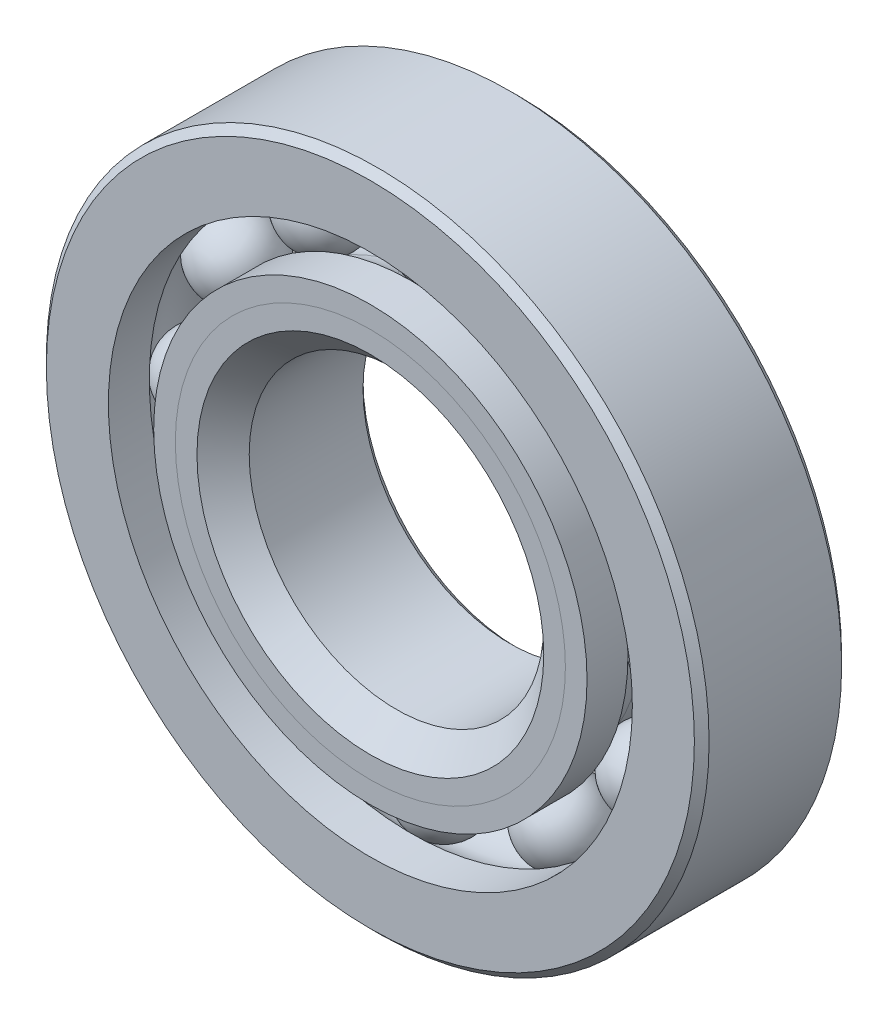
ISO-10303-21;
HEADER;
FILE_DESCRIPTION(('STEP AP214'),'2;1');
FILE_NAME('part.step','',(''),(''),'','','');
FILE_SCHEMA(('AUTOMOTIVE_DESIGN { 1 0 10303 214 1 1 1 1 }'));
ENDSEC;
DATA;
#1=APPLICATION_CONTEXT('core data for automotive mechanical design processes');
#2=APPLICATION_PROTOCOL_DEFINITION('international standard','automotive_design',2000,#1);
#3=PRODUCT_CONTEXT('',#1,'mechanical');
#4=PRODUCT('Part','Part','',(#3));
#5=PRODUCT_RELATED_PRODUCT_CATEGORY('part','',(#4));
#6=PRODUCT_DEFINITION_FORMATION('','',#4);
#7=PRODUCT_DEFINITION_CONTEXT('part definition',#1,'design');
#8=PRODUCT_DEFINITION('design','',#6,#7);
#9=PRODUCT_DEFINITION_SHAPE('','',#8);
#10=(LENGTH_UNIT() NAMED_UNIT(*) SI_UNIT(.MILLI.,.METRE.));
#11=(NAMED_UNIT(*) PLANE_ANGLE_UNIT() SI_UNIT($,.RADIAN.));
#12=(NAMED_UNIT(*) SI_UNIT($,.STERADIAN.) SOLID_ANGLE_UNIT());
#13=UNCERTAINTY_MEASURE_WITH_UNIT(LENGTH_MEASURE(1.E-05),#10,'distance_accuracy_value','');
#14=(GEOMETRIC_REPRESENTATION_CONTEXT(3) GLOBAL_UNCERTAINTY_ASSIGNED_CONTEXT((#13)) GLOBAL_UNIT_ASSIGNED_CONTEXT((#10,
#11,#12)) REPRESENTATION_CONTEXT('',''));
#15=CARTESIAN_POINT('',(0.,0.,0.));
#16=DIRECTION('',(0.,0.,1.));
#17=DIRECTION('',(1.,0.,0.));
#18=AXIS2_PLACEMENT_3D('',#15,#16,#17);
#19=CARTESIAN_POINT('',(-5.15937499999989,8.93629963530074,0.));
#20=DIRECTION('',(0.,0.,1.));
#21=DIRECTION('',(-0.499999999999989,0.866025403784445,0.));
#22=AXIS2_PLACEMENT_3D('',#19,#20,#21);
#23=SPHERICAL_SURFACE('',#22,1.71627890103156);
#24=CARTESIAN_POINT('',(-5.15937499999989,8.93629963530074,1.71627890103155));
#25=VERTEX_POINT('',#24);
#26=VERTEX_LOOP('',#25);
#27=FACE_BOUND('',#26,.T.);
#28=ADVANCED_FACE('F37',(#27),#23,.T.);
#29=CLOSED_SHELL('',(#28));
#30=MANIFOLD_SOLID_BREP('B2',#29);
#31=CARTESIAN_POINT('',(-8.93629963530062,5.1593750000001,0.));
#32=DIRECTION('',(0.,0.,1.));
#33=DIRECTION('',(-0.866025403784433,0.50000000000001,0.));
#34=AXIS2_PLACEMENT_3D('',#31,#32,#33);
#35=SPHERICAL_SURFACE('',#34,1.71627890103156);
#36=CARTESIAN_POINT('',(-8.93629963530062,5.1593750000001,1.71627890103155));
#37=VERTEX_POINT('',#36);
#38=VERTEX_LOOP('',#37);
#39=FACE_BOUND('',#38,.T.);
#40=ADVANCED_FACE('F68',(#39),#35,.T.);
#41=CLOSED_SHELL('',(#40));
#42=MANIFOLD_SOLID_BREP('B6',#41);
#43=CARTESIAN_POINT('',(-10.31875,1.08083169195563E-13,0.));
#44=DIRECTION('',(0.,0.,1.));
#45=DIRECTION('',(-1.,0.,0.));
#46=AXIS2_PLACEMENT_3D('',#43,#44,#45);
#47=SPHERICAL_SURFACE('',#46,1.71627890103156);
#48=CARTESIAN_POINT('',(-10.31875,1.08083169195563E-13,1.71627890103155));
#49=VERTEX_POINT('',#48);
#50=VERTEX_LOOP('',#49);
#51=FACE_BOUND('',#50,.T.);
#52=ADVANCED_FACE('F99',(#51),#47,.T.);
#53=CLOSED_SHELL('',(#52));
#54=MANIFOLD_SOLID_BREP('B33',#53);
#55=CARTESIAN_POINT('',(-8.93629963530072,-5.15937499999992,0.));
#56=DIRECTION('',(0.,0.,1.));
#57=DIRECTION('',(-0.866025403784443,-0.499999999999992,0.));
#58=AXIS2_PLACEMENT_3D('',#55,#56,#57);
#59=SPHERICAL_SURFACE('',#58,1.71627890103156);
#60=CARTESIAN_POINT('',(-8.93629963530072,-5.15937499999992,1.71627890103155));
#61=VERTEX_POINT('',#60);
#62=VERTEX_LOOP('',#61);
#63=FACE_BOUND('',#62,.T.);
#64=ADVANCED_FACE('F130',(#63),#59,.T.);
#65=CLOSED_SHELL('',(#64));
#66=MANIFOLD_SOLID_BREP('B64',#65);
#67=CARTESIAN_POINT('',(-5.15937500000007,-8.93629963530064,0.));
#68=DIRECTION('',(0.,0.,1.));
#69=DIRECTION('',(-0.500000000000007,-0.866025403784435,0.));
#70=AXIS2_PLACEMENT_3D('',#67,#68,#69);
#71=SPHERICAL_SURFACE('',#70,1.71627890103156);
#72=CARTESIAN_POINT('',(-5.15937500000007,-8.93629963530064,1.71627890103155));
#73=VERTEX_POINT('',#72);
#74=VERTEX_LOOP('',#73);
#75=FACE_BOUND('',#74,.T.);
#76=ADVANCED_FACE('F161',(#75),#71,.T.);
#77=CLOSED_SHELL('',(#76));
#78=MANIFOLD_SOLID_BREP('B95',#77);
#79=CARTESIAN_POINT('',(0.,-10.31875,0.));
#80=DIRECTION('',(0.,0.,1.));
#81=DIRECTION('',(0.,-1.,0.));
#82=AXIS2_PLACEMENT_3D('',#79,#80,#81);
#83=SPHERICAL_SURFACE('',#82,1.71627890103156);
#84=CARTESIAN_POINT('',(0.,-10.31875,1.71627890103155));
#85=VERTEX_POINT('',#84);
#86=VERTEX_LOOP('',#85);
#87=FACE_BOUND('',#86,.T.);
#88=ADVANCED_FACE('F192',(#87),#83,.T.);
#89=CLOSED_SHELL('',(#88));
#90=MANIFOLD_SOLID_BREP('B126',#89);
#91=CARTESIAN_POINT('',(5.15937499999995,-8.93629963530071,0.));
#92=DIRECTION('',(0.,0.,1.));
#93=DIRECTION('',(0.499999999999995,-0.866025403784442,0.));
#94=AXIS2_PLACEMENT_3D('',#91,#92,#93);
#95=SPHERICAL_SURFACE('',#94,1.71627890103156);
#96=CARTESIAN_POINT('',(5.15937499999995,-8.93629963530071,1.71627890103155));
#97=VERTEX_POINT('',#96);
#98=VERTEX_LOOP('',#97);
#99=FACE_BOUND('',#98,.T.);
#100=ADVANCED_FACE('F223',(#99),#95,.T.);
#101=CLOSED_SHELL('',(#100));
#102=MANIFOLD_SOLID_BREP('B157',#101);
#103=CARTESIAN_POINT('',(8.93629963530065,-5.15937500000004,0.));
#104=DIRECTION('',(0.,0.,1.));
#105=DIRECTION('',(0.866025403784436,-0.500000000000004,0.));
#106=AXIS2_PLACEMENT_3D('',#103,#104,#105);
#107=SPHERICAL_SURFACE('',#106,1.71627890103156);
#108=CARTESIAN_POINT('',(8.93629963530065,-5.15937500000004,1.71627890103155));
#109=VERTEX_POINT('',#108);
#110=VERTEX_LOOP('',#109);
#111=FACE_BOUND('',#110,.T.);
#112=ADVANCED_FACE('F254',(#111),#107,.T.);
#113=CLOSED_SHELL('',(#112));
#114=MANIFOLD_SOLID_BREP('B188',#113);
#115=CARTESIAN_POINT('',(10.31875,0.,0.));
#116=DIRECTION('',(0.,0.,1.));
#117=DIRECTION('',(1.,0.,0.));
#118=AXIS2_PLACEMENT_3D('',#115,#116,#117);
#119=SPHERICAL_SURFACE('',#118,1.71627890103156);
#120=CARTESIAN_POINT('',(10.31875,0.,1.71627890103155));
#121=VERTEX_POINT('',#120);
#122=VERTEX_LOOP('',#121);
#123=FACE_BOUND('',#122,.T.);
#124=ADVANCED_FACE('F285',(#123),#119,.T.);
#125=CLOSED_SHELL('',(#124));
#126=MANIFOLD_SOLID_BREP('B219',#125);
#127=CARTESIAN_POINT('',(8.93629963530069,5.15937499999998,0.));
#128=DIRECTION('',(0.,0.,1.));
#129=DIRECTION('',(0.86602540378444,0.499999999999998,0.));
#130=AXIS2_PLACEMENT_3D('',#127,#128,#129);
#131=SPHERICAL_SURFACE('',#130,1.71627890103156);
#132=CARTESIAN_POINT('',(8.93629963530069,5.15937499999998,1.71627890103155));
#133=VERTEX_POINT('',#132);
#134=VERTEX_LOOP('',#133);
#135=FACE_BOUND('',#134,.T.);
#136=ADVANCED_FACE('F316',(#135),#131,.T.);
#137=CLOSED_SHELL('',(#136));
#138=MANIFOLD_SOLID_BREP('B250',#137);
#139=CARTESIAN_POINT('',(5.15937500000001,8.93629963530067,0.));
#140=DIRECTION('',(0.,0.,1.));
#141=DIRECTION('',(0.500000000000001,0.866025403784438,0.));
#142=AXIS2_PLACEMENT_3D('',#139,#140,#141);
#143=SPHERICAL_SURFACE('',#142,1.71627890103156);
#144=CARTESIAN_POINT('',(5.15937500000001,8.93629963530067,1.71627890103155));
#145=VERTEX_POINT('',#144);
#146=VERTEX_LOOP('',#145);
#147=FACE_BOUND('',#146,.T.);
#148=ADVANCED_FACE('F347',(#147),#143,.T.);
#149=CLOSED_SHELL('',(#148));
#150=MANIFOLD_SOLID_BREP('B281',#149);
#151=CARTESIAN_POINT('',(0.,10.31875,0.));
#152=DIRECTION('',(0.,0.,1.));
#153=DIRECTION('',(0.,1.,0.));
#154=AXIS2_PLACEMENT_3D('',#151,#152,#153);
#155=SPHERICAL_SURFACE('',#154,1.71627890103156);
#156=CARTESIAN_POINT('',(0.,10.31875,1.71627890103155));
#157=VERTEX_POINT('',#156);
#158=VERTEX_LOOP('',#157);
#159=FACE_BOUND('',#158,.T.);
#160=ADVANCED_FACE('F380',(#159),#155,.T.);
#161=CLOSED_SHELL('',(#160));
#162=MANIFOLD_SOLID_BREP('B312',#161);
#163=CARTESIAN_POINT('',(0.,8.40903123628057,3.175));
#164=DIRECTION('',(0.,0.,-1.));
#165=DIRECTION('',(-1.,0.,0.));
#166=AXIS2_PLACEMENT_3D('',#163,#164,#165);
#167=PLANE('',#166);
#168=CARTESIAN_POINT('',(0.,0.,3.175));
#169=DIRECTION('',(0.,0.,1.));
#170=DIRECTION('',(1.,0.,0.));
#171=AXIS2_PLACEMENT_3D('',#168,#169,#170);
#172=CIRCLE('',#171,7.47623554948422);
#173=CARTESIAN_POINT('',(7.47623554948422,0.,3.175));
#174=VERTEX_POINT('',#173);
#175=EDGE_CURVE('E434',#174,#174,#172,.T.);
#176=ORIENTED_EDGE('',*,*,#175,.F.);
#177=EDGE_LOOP('',(#176));
#178=FACE_BOUND('',#177,.T.);
#179=CARTESIAN_POINT('',(0.,0.,3.175));
#180=DIRECTION('',(0.,0.,1.));
#181=DIRECTION('',(1.,0.,0.));
#182=AXIS2_PLACEMENT_3D('',#179,#180,#181);
#183=CIRCLE('',#182,8.40903123628057);
#184=CARTESIAN_POINT('',(8.40903123628057,0.,3.175));
#185=VERTEX_POINT('',#184);
#186=EDGE_CURVE('E379',#185,#185,#183,.T.);
#187=ORIENTED_EDGE('',*,*,#186,.T.);
#188=EDGE_LOOP('',(#187));
#189=FACE_BOUND('',#188,.T.);
#190=ADVANCED_FACE('F400',(#178,#189),#167,.F.);
#191=CARTESIAN_POINT('',(0.,0.,2.24220431320365));
#192=DIRECTION('',(0.,0.,1.));
#193=DIRECTION('',(1.,0.,0.));
#194=AXIS2_PLACEMENT_3D('',#191,#192,#193);
#195=CONICAL_SURFACE('',#194,7.47623554948422,0.78539816339745);
#196=ORIENTED_EDGE('',*,*,#186,.F.);
#197=EDGE_LOOP('',(#196));
#198=FACE_BOUND('',#197,.T.);
#199=CARTESIAN_POINT('',(0.,0.,2.24220431320365));
#200=DIRECTION('',(0.,0.,1.));
#201=DIRECTION('',(1.,0.,0.));
#202=AXIS2_PLACEMENT_3D('',#199,#200,#201);
#203=CIRCLE('',#202,7.47623554948422);
#204=CARTESIAN_POINT('',(7.47623554948422,0.,2.24220431320365));
#205=VERTEX_POINT('',#204);
#206=EDGE_CURVE('E406',#205,#205,#203,.T.);
#207=ORIENTED_EDGE('',*,*,#206,.T.);
#208=EDGE_LOOP('',(#207));
#209=FACE_BOUND('',#208,.T.);
#210=ADVANCED_FACE('F441',(#198,#209),#195,.T.);
#211=CARTESIAN_POINT('',(0.,0.,3.175));
#212=DIRECTION('',(0.,0.,1.));
#213=DIRECTION('',(1.,0.,0.));
#214=AXIS2_PLACEMENT_3D('',#211,#212,#213);
#215=CYLINDRICAL_SURFACE('',#214,7.47623554948422);
#216=ORIENTED_EDGE('',*,*,#206,.F.);
#217=EDGE_LOOP('',(#216));
#218=FACE_BOUND('',#217,.T.);
#219=CARTESIAN_POINT('',(0.,0.,0.));
#220=DIRECTION('',(0.,0.,1.));
#221=DIRECTION('',(1.,0.,0.));
#222=AXIS2_PLACEMENT_3D('',#219,#220,#221);
#223=CIRCLE('',#222,7.47623554948422);
#224=CARTESIAN_POINT('',(7.47623554948422,0.,0.));
#225=VERTEX_POINT('',#224);
#226=EDGE_CURVE('E410',#225,#225,#223,.T.);
#227=ORIENTED_EDGE('',*,*,#226,.T.);
#228=EDGE_LOOP('',(#227));
#229=FACE_BOUND('',#228,.T.);
#230=ADVANCED_FACE('F445',(#218,#229),#215,.T.);
#231=CARTESIAN_POINT('',(0.,7.47623554948422,0.));
#232=DIRECTION('',(0.,0.,-1.));
#233=DIRECTION('',(-1.,0.,0.));
#234=AXIS2_PLACEMENT_3D('',#231,#232,#233);
#235=PLANE('',#234);
#236=ORIENTED_EDGE('',*,*,#226,.F.);
#237=EDGE_LOOP('',(#236));
#238=FACE_BOUND('',#237,.T.);
#239=CARTESIAN_POINT('',(0.,0.,0.));
#240=DIRECTION('',(0.,0.,1.));
#241=DIRECTION('',(1.,0.,0.));
#242=AXIS2_PLACEMENT_3D('',#239,#240,#241);
#243=CIRCLE('',#242,8.60247109896845);
#244=CARTESIAN_POINT('',(8.60247109896845,0.,0.));
#245=VERTEX_POINT('',#244);
#246=EDGE_CURVE('E414',#245,#245,#243,.T.);
#247=ORIENTED_EDGE('',*,*,#246,.T.);
#248=EDGE_LOOP('',(#247));
#249=FACE_BOUND('',#248,.T.);
#250=ADVANCED_FACE('F450',(#238,#249),#235,.F.);
#251=CARTESIAN_POINT('',(0.,0.,0.));
#252=DIRECTION('',(0.,0.,1.));
#253=DIRECTION('',(1.,0.,0.));
#254=AXIS2_PLACEMENT_3D('',#251,#252,#253);
#255=TOROIDAL_SURFACE('',#254,10.31875,1.71627890103155);
#256=ORIENTED_EDGE('',*,*,#246,.F.);
#257=EDGE_LOOP('',(#256));
#258=FACE_BOUND('',#257,.T.);
#259=CARTESIAN_POINT('',(0.,0.,-1.41111111111111));
#260=DIRECTION('',(0.,0.,1.));
#261=DIRECTION('',(1.,0.,0.));
#262=AXIS2_PLACEMENT_3D('',#259,#260,#261);
#263=CIRCLE('',#262,9.34182692307692);
#264=CARTESIAN_POINT('',(9.34182692307692,0.,-1.41111111111111));
#265=VERTEX_POINT('',#264);
#266=EDGE_CURVE('E419',#265,#265,#263,.T.);
#267=ORIENTED_EDGE('',*,*,#266,.T.);
#268=EDGE_LOOP('',(#267));
#269=FACE_BOUND('',#268,.T.);
#270=ADVANCED_FACE('F456',(#258,#269),#255,.F.);
#271=CARTESIAN_POINT('',(0.,0.,3.175));
#272=DIRECTION('',(0.,0.,1.));
#273=DIRECTION('',(1.,0.,0.));
#274=AXIS2_PLACEMENT_3D('',#271,#272,#273);
#275=CYLINDRICAL_SURFACE('',#274,9.34182692307692);
#276=ORIENTED_EDGE('',*,*,#266,.F.);
#277=EDGE_LOOP('',(#276));
#278=FACE_BOUND('',#277,.T.);
#279=CARTESIAN_POINT('',(0.,0.,-3.175));
#280=DIRECTION('',(0.,0.,1.));
#281=DIRECTION('',(1.,0.,0.));
#282=AXIS2_PLACEMENT_3D('',#279,#280,#281);
#283=CIRCLE('',#282,9.34182692307692);
#284=CARTESIAN_POINT('',(9.34182692307692,0.,-3.175));
#285=VERTEX_POINT('',#284);
#286=EDGE_CURVE('E422',#285,#285,#283,.T.);
#287=ORIENTED_EDGE('',*,*,#286,.T.);
#288=EDGE_LOOP('',(#287));
#289=FACE_BOUND('',#288,.T.);
#290=ADVANCED_FACE('F460',(#278,#289),#275,.T.);
#291=CARTESIAN_POINT('',(0.,6.6675,-3.175));
#292=DIRECTION('',(0.,0.,1.));
#293=DIRECTION('',(1.,0.,0.));
#294=AXIS2_PLACEMENT_3D('',#291,#292,#293);
#295=PLANE('',#294);
#296=ORIENTED_EDGE('',*,*,#286,.F.);
#297=EDGE_LOOP('',(#296));
#298=FACE_BOUND('',#297,.T.);
#299=CARTESIAN_POINT('',(0.,0.,-3.175));
#300=DIRECTION('',(0.,0.,1.));
#301=DIRECTION('',(1.,0.,0.));
#302=AXIS2_PLACEMENT_3D('',#299,#300,#301);
#303=CIRCLE('',#302,6.6675);
#304=CARTESIAN_POINT('',(6.6675,0.,-3.175));
#305=VERTEX_POINT('',#304);
#306=EDGE_CURVE('E425',#305,#305,#303,.T.);
#307=ORIENTED_EDGE('',*,*,#306,.T.);
#308=EDGE_LOOP('',(#307));
#309=FACE_BOUND('',#308,.T.);
#310=ADVANCED_FACE('F464',(#298,#309),#295,.F.);
#311=CARTESIAN_POINT('',(0.,0.,-2.8575));
#312=DIRECTION('',(0.,0.,-1.));
#313=DIRECTION('',(-1.,0.,0.));
#314=AXIS2_PLACEMENT_3D('',#311,#312,#313);
#315=CONICAL_SURFACE('',#314,6.35,0.785398163397446);
#316=ORIENTED_EDGE('',*,*,#306,.F.);
#317=EDGE_LOOP('',(#316));
#318=FACE_BOUND('',#317,.T.);
#319=CARTESIAN_POINT('',(0.,0.,-2.8575));
#320=DIRECTION('',(0.,0.,1.));
#321=DIRECTION('',(1.,0.,0.));
#322=AXIS2_PLACEMENT_3D('',#319,#320,#321);
#323=CIRCLE('',#322,6.35);
#324=CARTESIAN_POINT('',(6.35,0.,-2.8575));
#325=VERTEX_POINT('',#324);
#326=EDGE_CURVE('E428',#325,#325,#323,.T.);
#327=ORIENTED_EDGE('',*,*,#326,.T.);
#328=EDGE_LOOP('',(#327));
#329=FACE_BOUND('',#328,.T.);
#330=ADVANCED_FACE('F468',(#318,#329),#315,.F.);
#331=CARTESIAN_POINT('',(0.,0.,3.175));
#332=DIRECTION('',(0.,0.,1.));
#333=DIRECTION('',(1.,0.,0.));
#334=AXIS2_PLACEMENT_3D('',#331,#332,#333);
#335=CYLINDRICAL_SURFACE('',#334,6.35);
#336=ORIENTED_EDGE('',*,*,#326,.F.);
#337=EDGE_LOOP('',(#336));
#338=FACE_BOUND('',#337,.T.);
#339=CARTESIAN_POINT('',(0.,0.,2.04876445051578));
#340=DIRECTION('',(0.,0.,1.));
#341=DIRECTION('',(1.,0.,0.));
#342=AXIS2_PLACEMENT_3D('',#339,#340,#341);
#343=CIRCLE('',#342,6.35);
#344=CARTESIAN_POINT('',(6.35,0.,2.04876445051578));
#345=VERTEX_POINT('',#344);
#346=EDGE_CURVE('E431',#345,#345,#343,.T.);
#347=ORIENTED_EDGE('',*,*,#346,.T.);
#348=EDGE_LOOP('',(#347));
#349=FACE_BOUND('',#348,.T.);
#350=ADVANCED_FACE('F472',(#338,#349),#335,.F.);
#351=CARTESIAN_POINT('',(0.,0.,3.175));
#352=DIRECTION('',(0.,0.,1.));
#353=DIRECTION('',(1.,0.,0.));
#354=AXIS2_PLACEMENT_3D('',#351,#352,#353);
#355=CONICAL_SURFACE('',#354,7.47623554948422,0.78539816339745);
#356=ORIENTED_EDGE('',*,*,#346,.F.);
#357=EDGE_LOOP('',(#356));
#358=FACE_BOUND('',#357,.T.);
#359=ORIENTED_EDGE('',*,*,#175,.T.);
#360=EDGE_LOOP('',(#359));
#361=FACE_BOUND('',#360,.T.);
#362=ADVANCED_FACE('F438',(#358,#361),#355,.F.);
#363=CLOSED_SHELL('',(#190,#210,#230,#250,#270,#290,#310,#330,#350,#362));
#364=MANIFOLD_SOLID_BREP('B343',#363);
#365=CARTESIAN_POINT('',(0.,9.34182692307692,3.175));
#366=DIRECTION('',(0.,0.,-1.));
#367=DIRECTION('',(-1.,0.,0.));
#368=AXIS2_PLACEMENT_3D('',#365,#366,#367);
#369=PLANE('',#368);
#370=CARTESIAN_POINT('',(0.,0.,3.175));
#371=DIRECTION('',(0.,0.,1.));
#372=DIRECTION('',(1.,0.,0.));
#373=AXIS2_PLACEMENT_3D('',#370,#371,#372);
#374=CIRCLE('',#373,8.40903123628057);
#375=CARTESIAN_POINT('',(8.40903123628057,0.,3.175));
#376=VERTEX_POINT('',#375);
#377=EDGE_CURVE('E399',#376,#376,#374,.T.);
#378=ORIENTED_EDGE('',*,*,#377,.F.);
#379=EDGE_LOOP('',(#378));
#380=FACE_BOUND('',#379,.T.);
#381=CARTESIAN_POINT('',(0.,0.,3.175));
#382=DIRECTION('',(0.,0.,1.));
#383=DIRECTION('',(1.,0.,0.));
#384=AXIS2_PLACEMENT_3D('',#381,#382,#383);
#385=CIRCLE('',#384,9.34182692307692);
#386=CARTESIAN_POINT('',(9.34182692307692,0.,3.175));
#387=VERTEX_POINT('',#386);
#388=EDGE_CURVE('E580',#387,#387,#385,.T.);
#389=ORIENTED_EDGE('',*,*,#388,.T.);
#390=EDGE_LOOP('',(#389));
#391=FACE_BOUND('',#390,.T.);
#392=ADVANCED_FACE('F558',(#380,#391),#369,.F.);
#393=CARTESIAN_POINT('',(0.,0.,3.175));
#394=DIRECTION('',(0.,0.,1.));
#395=DIRECTION('',(1.,0.,0.));
#396=AXIS2_PLACEMENT_3D('',#393,#394,#395);
#397=CONICAL_SURFACE('',#396,8.40903123628057,0.78539816339745);
#398=CARTESIAN_POINT('',(0.,0.,2.24220431320365));
#399=DIRECTION('',(0.,0.,1.));
#400=DIRECTION('',(1.,0.,0.));
#401=AXIS2_PLACEMENT_3D('',#398,#399,#400);
#402=CIRCLE('',#401,7.47623554948422);
#403=CARTESIAN_POINT('',(7.47623554948422,0.,2.24220431320365));
#404=VERTEX_POINT('',#403);
#405=EDGE_CURVE('E564',#404,#404,#402,.T.);
#406=ORIENTED_EDGE('',*,*,#405,.F.);
#407=EDGE_LOOP('',(#406));
#408=FACE_BOUND('',#407,.T.);
#409=ORIENTED_EDGE('',*,*,#377,.T.);
#410=EDGE_LOOP('',(#409));
#411=FACE_BOUND('',#410,.T.);
#412=ADVANCED_FACE('F605',(#408,#411),#397,.F.);
#413=CARTESIAN_POINT('',(0.,0.,3.175));
#414=DIRECTION('',(0.,0.,1.));
#415=DIRECTION('',(1.,0.,0.));
#416=AXIS2_PLACEMENT_3D('',#413,#414,#415);
#417=CYLINDRICAL_SURFACE('',#416,7.47623554948422);
#418=CARTESIAN_POINT('',(0.,0.,0.));
#419=DIRECTION('',(0.,0.,1.));
#420=DIRECTION('',(1.,0.,0.));
#421=AXIS2_PLACEMENT_3D('',#418,#419,#420);
#422=CIRCLE('',#421,7.47623554948422);
#423=CARTESIAN_POINT('',(7.47623554948422,0.,0.));
#424=VERTEX_POINT('',#423);
#425=EDGE_CURVE('E568',#424,#424,#422,.T.);
#426=ORIENTED_EDGE('',*,*,#425,.F.);
#427=EDGE_LOOP('',(#426));
#428=FACE_BOUND('',#427,.T.);
#429=ORIENTED_EDGE('',*,*,#405,.T.);
#430=EDGE_LOOP('',(#429));
#431=FACE_BOUND('',#430,.T.);
#432=ADVANCED_FACE('F600',(#428,#431),#417,.F.);
#433=CARTESIAN_POINT('',(0.,7.47623554948422,0.));
#434=DIRECTION('',(0.,0.,1.));
#435=DIRECTION('',(1.,0.,0.));
#436=AXIS2_PLACEMENT_3D('',#433,#434,#435);
#437=PLANE('',#436);
#438=CARTESIAN_POINT('',(0.,0.,0.));
#439=DIRECTION('',(0.,0.,1.));
#440=DIRECTION('',(1.,0.,0.));
#441=AXIS2_PLACEMENT_3D('',#438,#439,#440);
#442=CIRCLE('',#441,8.60247109896845);
#443=CARTESIAN_POINT('',(8.60247109896845,0.,0.));
#444=VERTEX_POINT('',#443);
#445=EDGE_CURVE('E572',#444,#444,#442,.T.);
#446=ORIENTED_EDGE('',*,*,#445,.F.);
#447=EDGE_LOOP('',(#446));
#448=FACE_BOUND('',#447,.T.);
#449=ORIENTED_EDGE('',*,*,#425,.T.);
#450=EDGE_LOOP('',(#449));
#451=FACE_BOUND('',#450,.T.);
#452=ADVANCED_FACE('F594',(#448,#451),#437,.F.);
#453=CARTESIAN_POINT('',(0.,0.,0.));
#454=DIRECTION('',(0.,0.,1.));
#455=DIRECTION('',(1.,0.,0.));
#456=AXIS2_PLACEMENT_3D('',#453,#454,#455);
#457=TOROIDAL_SURFACE('',#456,10.31875,1.71627890103156);
#458=CARTESIAN_POINT('',(0.,0.,1.41111111111111));
#459=DIRECTION('',(0.,0.,1.));
#460=DIRECTION('',(1.,0.,0.));
#461=AXIS2_PLACEMENT_3D('',#458,#459,#460);
#462=CIRCLE('',#461,9.34182692307692);
#463=CARTESIAN_POINT('',(9.34182692307692,0.,1.41111111111111));
#464=VERTEX_POINT('',#463);
#465=EDGE_CURVE('E577',#464,#464,#462,.T.);
#466=ORIENTED_EDGE('',*,*,#465,.F.);
#467=EDGE_LOOP('',(#466));
#468=FACE_BOUND('',#467,.T.);
#469=ORIENTED_EDGE('',*,*,#445,.T.);
#470=EDGE_LOOP('',(#469));
#471=FACE_BOUND('',#470,.T.);
#472=ADVANCED_FACE('F588',(#468,#471),#457,.F.);
#473=CARTESIAN_POINT('',(0.,0.,3.175));
#474=DIRECTION('',(0.,0.,1.));
#475=DIRECTION('',(1.,0.,0.));
#476=AXIS2_PLACEMENT_3D('',#473,#474,#475);
#477=CYLINDRICAL_SURFACE('',#476,9.34182692307692);
#478=ORIENTED_EDGE('',*,*,#388,.F.);
#479=EDGE_LOOP('',(#478));
#480=FACE_BOUND('',#479,.T.);
#481=ORIENTED_EDGE('',*,*,#465,.T.);
#482=EDGE_LOOP('',(#481));
#483=FACE_BOUND('',#482,.T.);
#484=ADVANCED_FACE('F585',(#480,#483),#477,.T.);
#485=CLOSED_SHELL('',(#392,#412,#432,#452,#472,#484));
#486=MANIFOLD_SOLID_BREP('B374',#485);
#487=CARTESIAN_POINT('',(0.,0.,2.8575));
#488=DIRECTION('',(0.,0.,-1.));
#489=DIRECTION('',(-1.,0.,0.));
#490=AXIS2_PLACEMENT_3D('',#487,#488,#489);
#491=CONICAL_SURFACE('',#490,14.2875,0.785398163397451);
#492=CARTESIAN_POINT('',(0.,0.,3.175));
#493=DIRECTION('',(0.,0.,1.));
#494=DIRECTION('',(1.,0.,0.));
#495=AXIS2_PLACEMENT_3D('',#492,#493,#494);
#496=CIRCLE('',#495,13.97);
#497=CARTESIAN_POINT('',(13.97,0.,3.175));
#498=VERTEX_POINT('',#497);
#499=EDGE_CURVE('E677',#498,#498,#496,.T.);
#500=ORIENTED_EDGE('',*,*,#499,.F.);
#501=EDGE_LOOP('',(#500));
#502=FACE_BOUND('',#501,.T.);
#503=CARTESIAN_POINT('',(0.,0.,2.8575));
#504=DIRECTION('',(0.,0.,1.));
#505=DIRECTION('',(1.,0.,0.));
#506=AXIS2_PLACEMENT_3D('',#503,#504,#505);
#507=CIRCLE('',#506,14.2875);
#508=CARTESIAN_POINT('',(14.2875,0.,2.8575));
#509=VERTEX_POINT('',#508);
#510=EDGE_CURVE('E557',#509,#509,#507,.T.);
#511=ORIENTED_EDGE('',*,*,#510,.T.);
#512=EDGE_LOOP('',(#511));
#513=FACE_BOUND('',#512,.T.);
#514=ADVANCED_FACE('F649',(#502,#513),#491,.T.);
#515=CARTESIAN_POINT('',(0.,0.,3.175));
#516=DIRECTION('',(0.,0.,1.));
#517=DIRECTION('',(1.,0.,0.));
#518=AXIS2_PLACEMENT_3D('',#515,#516,#517);
#519=CYLINDRICAL_SURFACE('',#518,14.2875);
#520=ORIENTED_EDGE('',*,*,#510,.F.);
#521=EDGE_LOOP('',(#520));
#522=FACE_BOUND('',#521,.T.);
#523=CARTESIAN_POINT('',(0.,0.,-2.8575));
#524=DIRECTION('',(0.,0.,1.));
#525=DIRECTION('',(1.,0.,0.));
#526=AXIS2_PLACEMENT_3D('',#523,#524,#525);
#527=CIRCLE('',#526,14.2875);
#528=CARTESIAN_POINT('',(14.2875,0.,-2.8575));
#529=VERTEX_POINT('',#528);
#530=EDGE_CURVE('E655',#529,#529,#527,.T.);
#531=ORIENTED_EDGE('',*,*,#530,.T.);
#532=EDGE_LOOP('',(#531));
#533=FACE_BOUND('',#532,.T.);
#534=ADVANCED_FACE('F684',(#522,#533),#519,.T.);
#535=CARTESIAN_POINT('',(0.,0.,-3.175));
#536=DIRECTION('',(0.,0.,1.));
#537=DIRECTION('',(1.,0.,0.));
#538=AXIS2_PLACEMENT_3D('',#535,#536,#537);
#539=CONICAL_SURFACE('',#538,13.97,0.785398163397451);
#540=ORIENTED_EDGE('',*,*,#530,.F.);
#541=EDGE_LOOP('',(#540));
#542=FACE_BOUND('',#541,.T.);
#543=CARTESIAN_POINT('',(0.,0.,-3.175));
#544=DIRECTION('',(0.,0.,1.));
#545=DIRECTION('',(1.,0.,0.));
#546=AXIS2_PLACEMENT_3D('',#543,#544,#545);
#547=CIRCLE('',#546,13.97);
#548=CARTESIAN_POINT('',(13.97,0.,-3.175));
#549=VERTEX_POINT('',#548);
#550=EDGE_CURVE('E659',#549,#549,#547,.T.);
#551=ORIENTED_EDGE('',*,*,#550,.T.);
#552=EDGE_LOOP('',(#551));
#553=FACE_BOUND('',#552,.T.);
#554=ADVANCED_FACE('F688',(#542,#553),#539,.T.);
#555=CARTESIAN_POINT('',(0.,13.97,-3.175));
#556=DIRECTION('',(0.,0.,1.));
#557=DIRECTION('',(1.,0.,0.));
#558=AXIS2_PLACEMENT_3D('',#555,#556,#557);
#559=PLANE('',#558);
#560=ORIENTED_EDGE('',*,*,#550,.F.);
#561=EDGE_LOOP('',(#560));
#562=FACE_BOUND('',#561,.T.);
#563=CARTESIAN_POINT('',(0.,0.,-3.175));
#564=DIRECTION('',(0.,0.,1.));
#565=DIRECTION('',(1.,0.,0.));
#566=AXIS2_PLACEMENT_3D('',#563,#564,#565);
#567=CIRCLE('',#566,11.2956730769231);
#568=CARTESIAN_POINT('',(11.2956730769231,0.,-3.175));
#569=VERTEX_POINT('',#568);
#570=EDGE_CURVE('E663',#569,#569,#567,.T.);
#571=ORIENTED_EDGE('',*,*,#570,.T.);
#572=EDGE_LOOP('',(#571));
#573=FACE_BOUND('',#572,.T.);
#574=ADVANCED_FACE('F693',(#562,#573),#559,.F.);
#575=CARTESIAN_POINT('',(0.,0.,3.175));
#576=DIRECTION('',(0.,0.,1.));
#577=DIRECTION('',(1.,0.,0.));
#578=AXIS2_PLACEMENT_3D('',#575,#576,#577);
#579=CYLINDRICAL_SURFACE('',#578,11.2956730769231);
#580=ORIENTED_EDGE('',*,*,#570,.F.);
#581=EDGE_LOOP('',(#580));
#582=FACE_BOUND('',#581,.T.);
#583=CARTESIAN_POINT('',(0.,0.,-1.41111111111111));
#584=DIRECTION('',(0.,0.,1.));
#585=DIRECTION('',(1.,0.,0.));
#586=AXIS2_PLACEMENT_3D('',#583,#584,#585);
#587=CIRCLE('',#586,11.2956730769231);
#588=CARTESIAN_POINT('',(11.2956730769231,0.,-1.41111111111111));
#589=VERTEX_POINT('',#588);
#590=EDGE_CURVE('E668',#589,#589,#587,.T.);
#591=ORIENTED_EDGE('',*,*,#590,.T.);
#592=EDGE_LOOP('',(#591));
#593=FACE_BOUND('',#592,.T.);
#594=ADVANCED_FACE('F699',(#582,#593),#579,.F.);
#595=CARTESIAN_POINT('',(0.,0.,0.));
#596=DIRECTION('',(0.,0.,1.));
#597=DIRECTION('',(1.,0.,0.));
#598=AXIS2_PLACEMENT_3D('',#595,#596,#597);
#599=TOROIDAL_SURFACE('',#598,10.31875,1.71627890103156);
#600=ORIENTED_EDGE('',*,*,#590,.F.);
#601=EDGE_LOOP('',(#600));
#602=FACE_BOUND('',#601,.T.);
#603=CARTESIAN_POINT('',(0.,0.,1.41111111111111));
#604=DIRECTION('',(0.,0.,1.));
#605=DIRECTION('',(1.,0.,0.));
#606=AXIS2_PLACEMENT_3D('',#603,#604,#605);
#607=CIRCLE('',#606,11.2956730769231);
#608=CARTESIAN_POINT('',(11.2956730769231,0.,1.41111111111111));
#609=VERTEX_POINT('',#608);
#610=EDGE_CURVE('E671',#609,#609,#607,.T.);
#611=ORIENTED_EDGE('',*,*,#610,.T.);
#612=EDGE_LOOP('',(#611));
#613=FACE_BOUND('',#612,.T.);
#614=ADVANCED_FACE('F703',(#602,#613),#599,.F.);
#615=CARTESIAN_POINT('',(0.,0.,3.175));
#616=DIRECTION('',(0.,0.,1.));
#617=DIRECTION('',(1.,0.,0.));
#618=AXIS2_PLACEMENT_3D('',#615,#616,#617);
#619=CYLINDRICAL_SURFACE('',#618,11.2956730769231);
#620=ORIENTED_EDGE('',*,*,#610,.F.);
#621=EDGE_LOOP('',(#620));
#622=FACE_BOUND('',#621,.T.);
#623=CARTESIAN_POINT('',(0.,0.,3.175));
#624=DIRECTION('',(0.,0.,1.));
#625=DIRECTION('',(1.,0.,0.));
#626=AXIS2_PLACEMENT_3D('',#623,#624,#625);
#627=CIRCLE('',#626,11.2956730769231);
#628=CARTESIAN_POINT('',(11.2956730769231,0.,3.175));
#629=VERTEX_POINT('',#628);
#630=EDGE_CURVE('E674',#629,#629,#627,.T.);
#631=ORIENTED_EDGE('',*,*,#630,.T.);
#632=EDGE_LOOP('',(#631));
#633=FACE_BOUND('',#632,.T.);
#634=ADVANCED_FACE('F707',(#622,#633),#619,.F.);
#635=CARTESIAN_POINT('',(0.,13.97,3.175));
#636=DIRECTION('',(0.,0.,-1.));
#637=DIRECTION('',(-1.,0.,0.));
#638=AXIS2_PLACEMENT_3D('',#635,#636,#637);
#639=PLANE('',#638);
#640=ORIENTED_EDGE('',*,*,#630,.F.);
#641=EDGE_LOOP('',(#640));
#642=FACE_BOUND('',#641,.T.);
#643=ORIENTED_EDGE('',*,*,#499,.T.);
#644=EDGE_LOOP('',(#643));
#645=FACE_BOUND('',#644,.T.);
#646=ADVANCED_FACE('F681',(#642,#645),#639,.F.);
#647=CLOSED_SHELL('',(#514,#534,#554,#574,#594,#614,#634,#646));
#648=MANIFOLD_SOLID_BREP('B394',#647);
#649=ADVANCED_BREP_SHAPE_REPRESENTATION('',(#18,#30,#42,#54,#66,#78,#90,#102,#114,#126,#138,
#150,#162,#364,#486,#648),#14);
#650=SHAPE_DEFINITION_REPRESENTATION(#9,#649);
ENDSEC;
END-ISO-10303-21;
